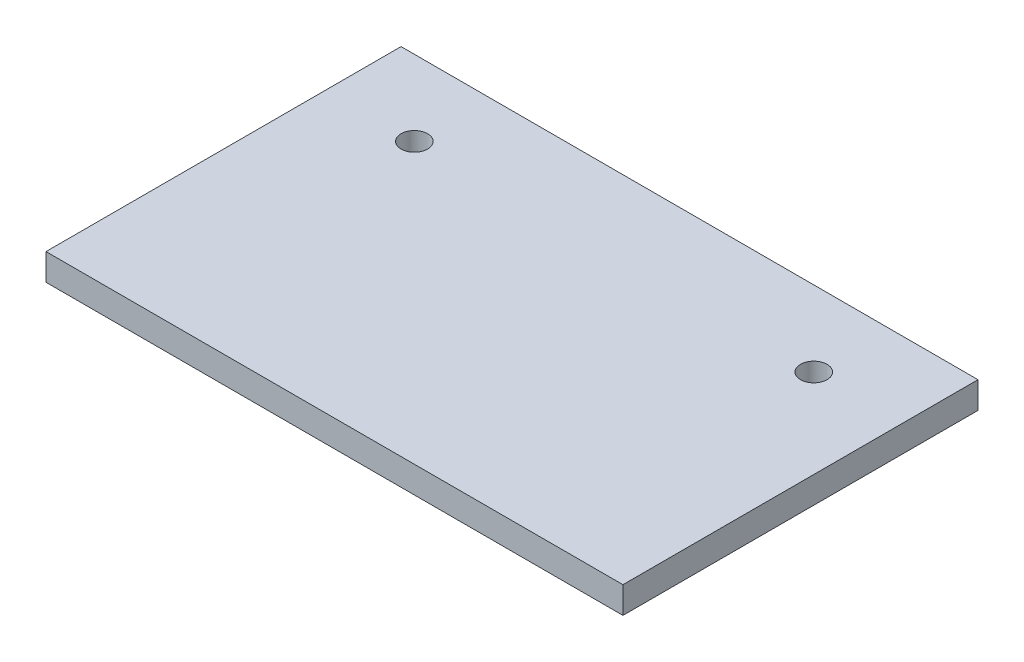
ISO-10303-21;
HEADER;
FILE_DESCRIPTION(('STEP AP214'),'2;1');
FILE_NAME('part.step','',(''),(''),'','','');
FILE_SCHEMA(('AUTOMOTIVE_DESIGN { 1 0 10303 214 1 1 1 1 }'));
ENDSEC;
DATA;
#1=APPLICATION_CONTEXT('core data for automotive mechanical design processes');
#2=APPLICATION_PROTOCOL_DEFINITION('international standard','automotive_design',2000,#1);
#3=PRODUCT_CONTEXT('',#1,'mechanical');
#4=PRODUCT('Part','Part','',(#3));
#5=PRODUCT_RELATED_PRODUCT_CATEGORY('part','',(#4));
#6=PRODUCT_DEFINITION_FORMATION('','',#4);
#7=PRODUCT_DEFINITION_CONTEXT('part definition',#1,'design');
#8=PRODUCT_DEFINITION('design','',#6,#7);
#9=PRODUCT_DEFINITION_SHAPE('','',#8);
#10=(LENGTH_UNIT() NAMED_UNIT(*) SI_UNIT(.MILLI.,.METRE.));
#11=(NAMED_UNIT(*) PLANE_ANGLE_UNIT() SI_UNIT($,.RADIAN.));
#12=(NAMED_UNIT(*) SI_UNIT($,.STERADIAN.) SOLID_ANGLE_UNIT());
#13=UNCERTAINTY_MEASURE_WITH_UNIT(LENGTH_MEASURE(1.E-05),#10,'distance_accuracy_value','');
#14=(GEOMETRIC_REPRESENTATION_CONTEXT(3) GLOBAL_UNCERTAINTY_ASSIGNED_CONTEXT((#13)) GLOBAL_UNIT_ASSIGNED_CONTEXT((#10,
#11,#12)) REPRESENTATION_CONTEXT('',''));
#15=CARTESIAN_POINT('',(0.,0.,0.));
#16=DIRECTION('',(0.,0.,1.));
#17=DIRECTION('',(1.,0.,0.));
#18=AXIS2_PLACEMENT_3D('',#15,#16,#17);
#19=CARTESIAN_POINT('',(0.,3.,40.));
#20=DIRECTION('',(1.,0.,0.));
#21=DIRECTION('',(0.,0.,-1.));
#22=AXIS2_PLACEMENT_3D('',#19,#20,#21);
#23=PLANE('',#22);
#24=DIRECTION('',(0.,0.,1.));
#25=VECTOR('',#24,1.);
#26=CARTESIAN_POINT('',(0.,0.,40.));
#27=LINE('',#26,#25);
#28=CARTESIAN_POINT('',(0.,0.,0.));
#29=VERTEX_POINT('',#28);
#30=CARTESIAN_POINT('',(0.,0.,40.));
#31=VERTEX_POINT('',#30);
#32=EDGE_CURVE('E108',#29,#31,#27,.T.);
#33=ORIENTED_EDGE('',*,*,#32,.T.);
#34=DIRECTION('',(0.,-1.,0.));
#35=VECTOR('',#34,1.);
#36=CARTESIAN_POINT('',(0.,3.,40.));
#37=LINE('',#36,#35);
#38=CARTESIAN_POINT('',(0.,3.,40.));
#39=VERTEX_POINT('',#38);
#40=EDGE_CURVE('E11',#39,#31,#37,.T.);
#41=ORIENTED_EDGE('',*,*,#40,.F.);
#42=DIRECTION('',(0.,0.,1.));
#43=VECTOR('',#42,1.);
#44=CARTESIAN_POINT('',(0.,3.,40.));
#45=LINE('',#44,#43);
#46=CARTESIAN_POINT('',(0.,3.,0.));
#47=VERTEX_POINT('',#46);
#48=EDGE_CURVE('E92',#47,#39,#45,.T.);
#49=ORIENTED_EDGE('',*,*,#48,.F.);
#50=DIRECTION('',(0.,-1.,0.));
#51=VECTOR('',#50,1.);
#52=CARTESIAN_POINT('',(0.,3.,0.));
#53=LINE('',#52,#51);
#54=EDGE_CURVE('E104',#47,#29,#53,.T.);
#55=ORIENTED_EDGE('',*,*,#54,.T.);
#56=EDGE_LOOP('',(#33,#41,#49,#55));
#57=FACE_BOUND('',#56,.T.);
#58=ADVANCED_FACE('F40',(#57),#23,.F.);
#59=CARTESIAN_POINT('',(65.,3.,40.));
#60=DIRECTION('',(0.,0.,-1.));
#61=DIRECTION('',(-1.,0.,0.));
#62=AXIS2_PLACEMENT_3D('',#59,#60,#61);
#63=PLANE('',#62);
#64=DIRECTION('',(1.,0.,0.));
#65=VECTOR('',#64,1.);
#66=CARTESIAN_POINT('',(65.,0.,40.));
#67=LINE('',#66,#65);
#68=CARTESIAN_POINT('',(65.,0.,40.));
#69=VERTEX_POINT('',#68);
#70=EDGE_CURVE('E97',#31,#69,#67,.T.);
#71=ORIENTED_EDGE('',*,*,#70,.T.);
#72=DIRECTION('',(0.,-1.,0.));
#73=VECTOR('',#72,1.);
#74=CARTESIAN_POINT('',(65.,3.,40.));
#75=LINE('',#74,#73);
#76=CARTESIAN_POINT('',(65.,3.,40.));
#77=VERTEX_POINT('',#76);
#78=EDGE_CURVE('E49',#77,#69,#75,.T.);
#79=ORIENTED_EDGE('',*,*,#78,.F.);
#80=DIRECTION('',(1.,0.,0.));
#81=VECTOR('',#80,1.);
#82=CARTESIAN_POINT('',(65.,3.,40.));
#83=LINE('',#82,#81);
#84=EDGE_CURVE('E87',#39,#77,#83,.T.);
#85=ORIENTED_EDGE('',*,*,#84,.F.);
#86=ORIENTED_EDGE('',*,*,#40,.T.);
#87=EDGE_LOOP('',(#71,#79,#85,#86));
#88=FACE_BOUND('',#87,.T.);
#89=ADVANCED_FACE('F96',(#88),#63,.F.);
#90=CARTESIAN_POINT('',(65.,3.,0.));
#91=DIRECTION('',(-1.,0.,0.));
#92=DIRECTION('',(0.,0.,1.));
#93=AXIS2_PLACEMENT_3D('',#90,#91,#92);
#94=PLANE('',#93);
#95=DIRECTION('',(0.,0.,-1.));
#96=VECTOR('',#95,1.);
#97=CARTESIAN_POINT('',(65.,0.,0.));
#98=LINE('',#97,#96);
#99=CARTESIAN_POINT('',(65.,0.,0.));
#100=VERTEX_POINT('',#99);
#101=EDGE_CURVE('E74',#69,#100,#98,.T.);
#102=ORIENTED_EDGE('',*,*,#101,.T.);
#103=DIRECTION('',(0.,-1.,0.));
#104=VECTOR('',#103,1.);
#105=CARTESIAN_POINT('',(65.,3.,0.));
#106=LINE('',#105,#104);
#107=CARTESIAN_POINT('',(65.,3.,0.));
#108=VERTEX_POINT('',#107);
#109=EDGE_CURVE('E99',#108,#100,#106,.T.);
#110=ORIENTED_EDGE('',*,*,#109,.F.);
#111=DIRECTION('',(0.,0.,-1.));
#112=VECTOR('',#111,1.);
#113=CARTESIAN_POINT('',(65.,3.,0.));
#114=LINE('',#113,#112);
#115=EDGE_CURVE('E90',#77,#108,#114,.T.);
#116=ORIENTED_EDGE('',*,*,#115,.F.);
#117=ORIENTED_EDGE('',*,*,#78,.T.);
#118=EDGE_LOOP('',(#102,#110,#116,#117));
#119=FACE_BOUND('',#118,.T.);
#120=ADVANCED_FACE('F100',(#119),#94,.F.);
#121=CARTESIAN_POINT('',(0.,3.,0.));
#122=DIRECTION('',(0.,0.,1.));
#123=DIRECTION('',(1.,0.,0.));
#124=AXIS2_PLACEMENT_3D('',#121,#122,#123);
#125=PLANE('',#124);
#126=DIRECTION('',(-1.,0.,0.));
#127=VECTOR('',#126,1.);
#128=CARTESIAN_POINT('',(0.,0.,0.));
#129=LINE('',#128,#127);
#130=EDGE_CURVE('E80',#100,#29,#129,.T.);
#131=ORIENTED_EDGE('',*,*,#130,.T.);
#132=ORIENTED_EDGE('',*,*,#54,.F.);
#133=DIRECTION('',(-1.,0.,0.));
#134=VECTOR('',#133,1.);
#135=CARTESIAN_POINT('',(0.,3.,0.));
#136=LINE('',#135,#134);
#137=EDGE_CURVE('E57',#108,#47,#136,.T.);
#138=ORIENTED_EDGE('',*,*,#137,.F.);
#139=ORIENTED_EDGE('',*,*,#109,.T.);
#140=EDGE_LOOP('',(#131,#132,#138,#139));
#141=FACE_BOUND('',#140,.T.);
#142=ADVANCED_FACE('F122',(#141),#125,.F.);
#143=CARTESIAN_POINT('',(0.,3.,0.));
#144=DIRECTION('',(0.,-1.,0.));
#145=DIRECTION('',(0.,0.,-1.));
#146=AXIS2_PLACEMENT_3D('',#143,#144,#145);
#147=PLANE('',#146);
#148=CARTESIAN_POINT('',(10.,3.,8.5));
#149=DIRECTION('',(0.,1.,0.));
#150=DIRECTION('',(0.,0.,1.));
#151=AXIS2_PLACEMENT_3D('',#148,#149,#150);
#152=CIRCLE('',#151,1.5);
#153=CARTESIAN_POINT('',(10.,3.,10.));
#154=VERTEX_POINT('',#153);
#155=EDGE_CURVE('E137',#154,#154,#152,.T.);
#156=ORIENTED_EDGE('',*,*,#155,.F.);
#157=EDGE_LOOP('',(#156));
#158=FACE_BOUND('',#157,.T.);
#159=CARTESIAN_POINT('',(55.,3.,8.5));
#160=DIRECTION('',(0.,1.,0.));
#161=DIRECTION('',(0.,0.,1.));
#162=AXIS2_PLACEMENT_3D('',#159,#160,#161);
#163=CIRCLE('',#162,1.5);
#164=CARTESIAN_POINT('',(55.,3.,10.));
#165=VERTEX_POINT('',#164);
#166=EDGE_CURVE('E129',#165,#165,#163,.T.);
#167=ORIENTED_EDGE('',*,*,#166,.F.);
#168=EDGE_LOOP('',(#167));
#169=FACE_BOUND('',#168,.T.);
#170=ORIENTED_EDGE('',*,*,#48,.T.);
#171=ORIENTED_EDGE('',*,*,#84,.T.);
#172=ORIENTED_EDGE('',*,*,#115,.T.);
#173=ORIENTED_EDGE('',*,*,#137,.T.);
#174=EDGE_LOOP('',(#170,#171,#172,#173));
#175=FACE_BOUND('',#174,.T.);
#176=ADVANCED_FACE('F88',(#158,#169,#175),#147,.F.);
#177=CARTESIAN_POINT('',(0.,0.,0.));
#178=DIRECTION('',(0.,-1.,0.));
#179=DIRECTION('',(0.,0.,-1.));
#180=AXIS2_PLACEMENT_3D('',#177,#178,#179);
#181=PLANE('',#180);
#182=CARTESIAN_POINT('',(10.,0.,8.5));
#183=DIRECTION('',(0.,1.,0.));
#184=DIRECTION('',(0.,0.,1.));
#185=AXIS2_PLACEMENT_3D('',#182,#183,#184);
#186=CIRCLE('',#185,1.5);
#187=CARTESIAN_POINT('',(10.,0.,10.));
#188=VERTEX_POINT('',#187);
#189=EDGE_CURVE('E112',#188,#188,#186,.T.);
#190=ORIENTED_EDGE('',*,*,#189,.T.);
#191=EDGE_LOOP('',(#190));
#192=FACE_BOUND('',#191,.T.);
#193=CARTESIAN_POINT('',(55.,0.,8.5));
#194=DIRECTION('',(0.,1.,0.));
#195=DIRECTION('',(0.,0.,1.));
#196=AXIS2_PLACEMENT_3D('',#193,#194,#195);
#197=CIRCLE('',#196,1.5);
#198=CARTESIAN_POINT('',(55.,0.,10.));
#199=VERTEX_POINT('',#198);
#200=EDGE_CURVE('E133',#199,#199,#197,.T.);
#201=ORIENTED_EDGE('',*,*,#200,.T.);
#202=EDGE_LOOP('',(#201));
#203=FACE_BOUND('',#202,.T.);
#204=ORIENTED_EDGE('',*,*,#32,.F.);
#205=ORIENTED_EDGE('',*,*,#130,.F.);
#206=ORIENTED_EDGE('',*,*,#101,.F.);
#207=ORIENTED_EDGE('',*,*,#70,.F.);
#208=EDGE_LOOP('',(#204,#205,#206,#207));
#209=FACE_BOUND('',#208,.T.);
#210=ADVANCED_FACE('F125',(#192,#203,#209),#181,.T.);
#211=CARTESIAN_POINT('',(55.,0.,8.5));
#212=DIRECTION('',(0.,1.,0.));
#213=DIRECTION('',(0.,0.,1.));
#214=AXIS2_PLACEMENT_3D('',#211,#212,#213);
#215=CYLINDRICAL_SURFACE('',#214,1.5);
#216=ORIENTED_EDGE('',*,*,#200,.F.);
#217=EDGE_LOOP('',(#216));
#218=FACE_BOUND('',#217,.T.);
#219=ORIENTED_EDGE('',*,*,#166,.T.);
#220=EDGE_LOOP('',(#219));
#221=FACE_BOUND('',#220,.T.);
#222=ADVANCED_FACE('F150',(#218,#221),#215,.F.);
#223=CARTESIAN_POINT('',(10.,0.,8.5));
#224=DIRECTION('',(0.,1.,0.));
#225=DIRECTION('',(0.,0.,1.));
#226=AXIS2_PLACEMENT_3D('',#223,#224,#225);
#227=CYLINDRICAL_SURFACE('',#226,1.5);
#228=ORIENTED_EDGE('',*,*,#189,.F.);
#229=EDGE_LOOP('',(#228));
#230=FACE_BOUND('',#229,.T.);
#231=ORIENTED_EDGE('',*,*,#155,.T.);
#232=EDGE_LOOP('',(#231));
#233=FACE_BOUND('',#232,.T.);
#234=ADVANCED_FACE('F147',(#230,#233),#227,.F.);
#235=CLOSED_SHELL('',(#58,#89,#120,#142,#176,#210,#222,#234));
#236=MANIFOLD_SOLID_BREP('B2',#235);
#237=ADVANCED_BREP_SHAPE_REPRESENTATION('',(#18,#236),#14);
#238=SHAPE_DEFINITION_REPRESENTATION(#9,#237);
ENDSEC;
END-ISO-10303-21;
